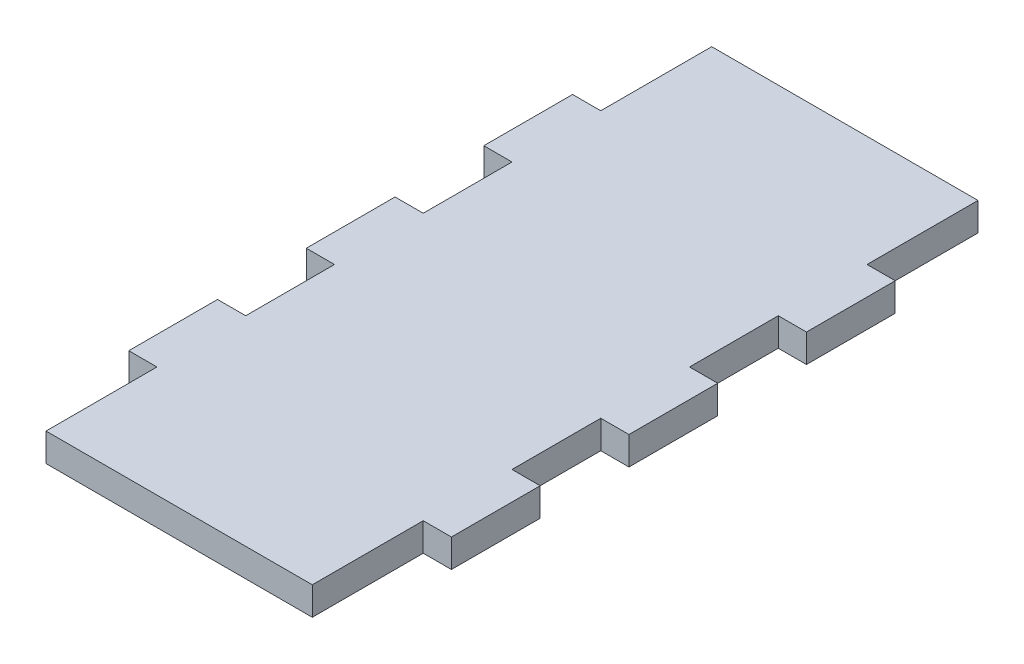
ISO-10303-21;
HEADER;
FILE_DESCRIPTION(('STEP AP214'),'2;1');
FILE_NAME('part.step','',(''),(''),'','','');
FILE_SCHEMA(('AUTOMOTIVE_DESIGN { 1 0 10303 214 1 1 1 1 }'));
ENDSEC;
DATA;
#1=APPLICATION_CONTEXT('core data for automotive mechanical design processes');
#2=APPLICATION_PROTOCOL_DEFINITION('international standard','automotive_design',2000,#1);
#3=PRODUCT_CONTEXT('',#1,'mechanical');
#4=PRODUCT('Part','Part','',(#3));
#5=PRODUCT_RELATED_PRODUCT_CATEGORY('part','',(#4));
#6=PRODUCT_DEFINITION_FORMATION('','',#4);
#7=PRODUCT_DEFINITION_CONTEXT('part definition',#1,'design');
#8=PRODUCT_DEFINITION('design','',#6,#7);
#9=PRODUCT_DEFINITION_SHAPE('','',#8);
#10=(LENGTH_UNIT() NAMED_UNIT(*) SI_UNIT(.MILLI.,.METRE.));
#11=(NAMED_UNIT(*) PLANE_ANGLE_UNIT() SI_UNIT($,.RADIAN.));
#12=(NAMED_UNIT(*) SI_UNIT($,.STERADIAN.) SOLID_ANGLE_UNIT());
#13=UNCERTAINTY_MEASURE_WITH_UNIT(LENGTH_MEASURE(1.E-05),#10,'distance_accuracy_value','');
#14=(GEOMETRIC_REPRESENTATION_CONTEXT(3) GLOBAL_UNCERTAINTY_ASSIGNED_CONTEXT((#13)) GLOBAL_UNIT_ASSIGNED_CONTEXT((#10,
#11,#12)) REPRESENTATION_CONTEXT('',''));
#15=CARTESIAN_POINT('',(0.,0.,0.));
#16=DIRECTION('',(0.,0.,1.));
#17=DIRECTION('',(1.,0.,0.));
#18=AXIS2_PLACEMENT_3D('',#15,#16,#17);
#19=CARTESIAN_POINT('',(15.,3.175,37.5));
#20=DIRECTION('',(-1.,0.,0.));
#21=DIRECTION('',(0.,0.,1.));
#22=AXIS2_PLACEMENT_3D('',#19,#20,#21);
#23=PLANE('',#22);
#24=DIRECTION('',(0.,0.,-1.));
#25=VECTOR('',#24,1.);
#26=CARTESIAN_POINT('',(15.,0.,37.5));
#27=LINE('',#26,#25);
#28=CARTESIAN_POINT('',(15.0000000000001,0.,-4.99999999999994));
#29=VERTEX_POINT('',#28);
#30=CARTESIAN_POINT('',(15.,0.,-15.));
#31=VERTEX_POINT('',#30);
#32=EDGE_CURVE('E439',#29,#31,#27,.T.);
#33=ORIENTED_EDGE('',*,*,#32,.T.);
#34=DIRECTION('',(0.,1.,0.));
#35=VECTOR('',#34,1.);
#36=CARTESIAN_POINT('',(15.0000000000001,-10.491931423718,-15.));
#37=LINE('',#36,#35);
#38=CARTESIAN_POINT('',(15.,3.175,-15.));
#39=VERTEX_POINT('',#38);
#40=EDGE_CURVE('E56',#31,#39,#37,.T.);
#41=ORIENTED_EDGE('',*,*,#40,.T.);
#42=DIRECTION('',(0.,0.,-1.));
#43=VECTOR('',#42,1.);
#44=CARTESIAN_POINT('',(15.,3.175,37.5));
#45=LINE('',#44,#43);
#46=CARTESIAN_POINT('',(15.,3.175,-4.99999999999994));
#47=VERTEX_POINT('',#46);
#48=EDGE_CURVE('E456',#47,#39,#45,.T.);
#49=ORIENTED_EDGE('',*,*,#48,.F.);
#50=DIRECTION('',(0.,1.,0.));
#51=VECTOR('',#50,1.);
#52=CARTESIAN_POINT('',(15.0000000000001,-10.491931423718,-4.99999999999994));
#53=LINE('',#52,#51);
#54=EDGE_CURVE('E270',#29,#47,#53,.T.);
#55=ORIENTED_EDGE('',*,*,#54,.F.);
#56=EDGE_LOOP('',(#33,#41,#49,#55));
#57=FACE_BOUND('',#56,.T.);
#58=ADVANCED_FACE('F33',(#57),#23,.F.);
#59=CARTESIAN_POINT('',(15.,0.,15.));
#60=VERTEX_POINT('',#59);
#61=CARTESIAN_POINT('',(15.,0.,5.00000000000006));
#62=VERTEX_POINT('',#61);
#63=EDGE_CURVE('E407',#60,#62,#27,.T.);
#64=ORIENTED_EDGE('',*,*,#63,.T.);
#65=DIRECTION('',(0.,1.,0.));
#66=VECTOR('',#65,1.);
#67=CARTESIAN_POINT('',(15.,-10.491931423718,5.00000000000006));
#68=LINE('',#67,#66);
#69=CARTESIAN_POINT('',(15.,3.175,5.00000000000006));
#70=VERTEX_POINT('',#69);
#71=EDGE_CURVE('E277',#62,#70,#68,.T.);
#72=ORIENTED_EDGE('',*,*,#71,.T.);
#73=CARTESIAN_POINT('',(15.,3.175,15.));
#74=VERTEX_POINT('',#73);
#75=EDGE_CURVE('E393',#74,#70,#45,.T.);
#76=ORIENTED_EDGE('',*,*,#75,.F.);
#77=DIRECTION('',(0.,1.,0.));
#78=VECTOR('',#77,1.);
#79=CARTESIAN_POINT('',(15.,-10.491931423718,15.));
#80=LINE('',#79,#78);
#81=EDGE_CURVE('E296',#60,#74,#80,.T.);
#82=ORIENTED_EDGE('',*,*,#81,.F.);
#83=EDGE_LOOP('',(#64,#72,#76,#82));
#84=FACE_BOUND('',#83,.T.);
#85=ADVANCED_FACE('F445',(#84),#23,.F.);
#86=CARTESIAN_POINT('',(15.,3.175,-25.));
#87=VERTEX_POINT('',#86);
#88=CARTESIAN_POINT('',(15.,3.175,-37.5));
#89=VERTEX_POINT('',#88);
#90=EDGE_CURVE('E48',#87,#89,#45,.T.);
#91=ORIENTED_EDGE('',*,*,#90,.F.);
#92=DIRECTION('',(0.,1.,0.));
#93=VECTOR('',#92,1.);
#94=CARTESIAN_POINT('',(15.0000000000001,-10.491931423718,-25.));
#95=LINE('',#94,#93);
#96=CARTESIAN_POINT('',(15.0000000000001,0.,-25.));
#97=VERTEX_POINT('',#96);
#98=EDGE_CURVE('E249',#97,#87,#95,.T.);
#99=ORIENTED_EDGE('',*,*,#98,.F.);
#100=CARTESIAN_POINT('',(15.,0.,-37.5));
#101=VERTEX_POINT('',#100);
#102=EDGE_CURVE('E388',#97,#101,#27,.T.);
#103=ORIENTED_EDGE('',*,*,#102,.T.);
#104=DIRECTION('',(0.,-1.,0.));
#105=VECTOR('',#104,1.);
#106=CARTESIAN_POINT('',(15.,3.175,-37.5));
#107=LINE('',#106,#105);
#108=EDGE_CURVE('E11',#89,#101,#107,.T.);
#109=ORIENTED_EDGE('',*,*,#108,.F.);
#110=EDGE_LOOP('',(#91,#99,#103,#109));
#111=FACE_BOUND('',#110,.T.);
#112=ADVANCED_FACE('F438',(#111),#23,.F.);
#113=CARTESIAN_POINT('',(-15.,3.175,37.5));
#114=DIRECTION('',(1.,0.,0.));
#115=DIRECTION('',(0.,0.,-1.));
#116=AXIS2_PLACEMENT_3D('',#113,#114,#115);
#117=PLANE('',#116);
#118=DIRECTION('',(0.,0.,1.));
#119=VECTOR('',#118,1.);
#120=CARTESIAN_POINT('',(-15.,0.,37.5));
#121=LINE('',#120,#119);
#122=CARTESIAN_POINT('',(-15.,0.,-37.5));
#123=VERTEX_POINT('',#122);
#124=CARTESIAN_POINT('',(-15.,0.,-25.));
#125=VERTEX_POINT('',#124);
#126=EDGE_CURVE('E410',#123,#125,#121,.T.);
#127=ORIENTED_EDGE('',*,*,#126,.T.);
#128=DIRECTION('',(0.,1.,0.));
#129=VECTOR('',#128,1.);
#130=CARTESIAN_POINT('',(-15.0000000000001,-10.491931423718,-25.));
#131=LINE('',#130,#129);
#132=CARTESIAN_POINT('',(-15.,3.175,-25.));
#133=VERTEX_POINT('',#132);
#134=EDGE_CURVE('E311',#125,#133,#131,.T.);
#135=ORIENTED_EDGE('',*,*,#134,.T.);
#136=DIRECTION('',(0.,0.,1.));
#137=VECTOR('',#136,1.);
#138=CARTESIAN_POINT('',(-15.,3.175,37.5));
#139=LINE('',#138,#137);
#140=CARTESIAN_POINT('',(-15.,3.175,-37.5));
#141=VERTEX_POINT('',#140);
#142=EDGE_CURVE('E396',#141,#133,#139,.T.);
#143=ORIENTED_EDGE('',*,*,#142,.F.);
#144=DIRECTION('',(0.,-1.,0.));
#145=VECTOR('',#144,1.);
#146=CARTESIAN_POINT('',(-15.,3.175,-37.5));
#147=LINE('',#146,#145);
#148=EDGE_CURVE('E41',#141,#123,#147,.T.);
#149=ORIENTED_EDGE('',*,*,#148,.T.);
#150=EDGE_LOOP('',(#127,#135,#143,#149));
#151=FACE_BOUND('',#150,.T.);
#152=ADVANCED_FACE('F424',(#151),#117,.F.);
#153=CARTESIAN_POINT('',(-15.,3.175,-15.));
#154=VERTEX_POINT('',#153);
#155=CARTESIAN_POINT('',(-15.,3.175,-4.99999999999994));
#156=VERTEX_POINT('',#155);
#157=EDGE_CURVE('E400',#154,#156,#139,.T.);
#158=ORIENTED_EDGE('',*,*,#157,.F.);
#159=DIRECTION('',(0.,1.,0.));
#160=VECTOR('',#159,1.);
#161=CARTESIAN_POINT('',(-15.0000000000001,-10.491931423718,-15.));
#162=LINE('',#161,#160);
#163=CARTESIAN_POINT('',(-15.0000000000001,0.,-15.));
#164=VERTEX_POINT('',#163);
#165=EDGE_CURVE('E320',#164,#154,#162,.T.);
#166=ORIENTED_EDGE('',*,*,#165,.F.);
#167=CARTESIAN_POINT('',(-15.,0.,-4.99999999999994));
#168=VERTEX_POINT('',#167);
#169=EDGE_CURVE('E413',#164,#168,#121,.T.);
#170=ORIENTED_EDGE('',*,*,#169,.T.);
#171=DIRECTION('',(0.,1.,0.));
#172=VECTOR('',#171,1.);
#173=CARTESIAN_POINT('',(-15.0000000000001,-10.491931423718,-4.99999999999994));
#174=LINE('',#173,#172);
#175=EDGE_CURVE('E338',#168,#156,#174,.T.);
#176=ORIENTED_EDGE('',*,*,#175,.T.);
#177=EDGE_LOOP('',(#158,#166,#170,#176));
#178=FACE_BOUND('',#177,.T.);
#179=ADVANCED_FACE('F478',(#178),#117,.F.);
#180=DIRECTION('',(0.,1.,0.));
#181=VECTOR('',#180,1.);
#182=CARTESIAN_POINT('',(-15.,-10.491931423718,25.));
#183=LINE('',#182,#181);
#184=CARTESIAN_POINT('',(-15.,0.,25.));
#185=VERTEX_POINT('',#184);
#186=CARTESIAN_POINT('',(-15.,3.175,25.));
#187=VERTEX_POINT('',#186);
#188=EDGE_CURVE('E377',#185,#187,#183,.T.);
#189=ORIENTED_EDGE('',*,*,#188,.F.);
#190=CARTESIAN_POINT('',(-15.,0.,37.5));
#191=VERTEX_POINT('',#190);
#192=EDGE_CURVE('E409',#185,#191,#121,.T.);
#193=ORIENTED_EDGE('',*,*,#192,.T.);
#194=DIRECTION('',(0.,-1.,0.));
#195=VECTOR('',#194,1.);
#196=CARTESIAN_POINT('',(-15.,3.175,37.5));
#197=LINE('',#196,#195);
#198=CARTESIAN_POINT('',(-15.,3.175,37.5));
#199=VERTEX_POINT('',#198);
#200=EDGE_CURVE('E417',#199,#191,#197,.T.);
#201=ORIENTED_EDGE('',*,*,#200,.F.);
#202=EDGE_CURVE('E395',#187,#199,#139,.T.);
#203=ORIENTED_EDGE('',*,*,#202,.F.);
#204=EDGE_LOOP('',(#189,#193,#201,#203));
#205=FACE_BOUND('',#204,.T.);
#206=ADVANCED_FACE('F471',(#205),#117,.F.);
#207=CARTESIAN_POINT('',(15.,0.,37.5));
#208=VERTEX_POINT('',#207);
#209=CARTESIAN_POINT('',(15.,0.,25.));
#210=VERTEX_POINT('',#209);
#211=EDGE_CURVE('E403',#208,#210,#27,.T.);
#212=ORIENTED_EDGE('',*,*,#211,.T.);
#213=DIRECTION('',(0.,1.,0.));
#214=VECTOR('',#213,1.);
#215=CARTESIAN_POINT('',(15.,-10.491931423718,25.));
#216=LINE('',#215,#214);
#217=CARTESIAN_POINT('',(15.,3.175,25.));
#218=VERTEX_POINT('',#217);
#219=EDGE_CURVE('E302',#210,#218,#216,.T.);
#220=ORIENTED_EDGE('',*,*,#219,.T.);
#221=CARTESIAN_POINT('',(15.,3.175,37.5));
#222=VERTEX_POINT('',#221);
#223=EDGE_CURVE('E389',#222,#218,#45,.T.);
#224=ORIENTED_EDGE('',*,*,#223,.F.);
#225=DIRECTION('',(0.,-1.,0.));
#226=VECTOR('',#225,1.);
#227=CARTESIAN_POINT('',(15.,3.175,37.5));
#228=LINE('',#227,#226);
#229=EDGE_CURVE('E402',#222,#208,#228,.T.);
#230=ORIENTED_EDGE('',*,*,#229,.T.);
#231=EDGE_LOOP('',(#212,#220,#224,#230));
#232=FACE_BOUND('',#231,.T.);
#233=ADVANCED_FACE('F35',(#232),#23,.F.);
#234=CARTESIAN_POINT('',(-15.,3.175,-37.5));
#235=DIRECTION('',(0.,0.,1.));
#236=DIRECTION('',(1.,0.,0.));
#237=AXIS2_PLACEMENT_3D('',#234,#235,#236);
#238=PLANE('',#237);
#239=DIRECTION('',(-1.,0.,0.));
#240=VECTOR('',#239,1.);
#241=CARTESIAN_POINT('',(-15.,0.,-37.5));
#242=LINE('',#241,#240);
#243=EDGE_CURVE('E406',#101,#123,#242,.T.);
#244=ORIENTED_EDGE('',*,*,#243,.T.);
#245=ORIENTED_EDGE('',*,*,#148,.F.);
#246=DIRECTION('',(-1.,0.,0.));
#247=VECTOR('',#246,1.);
#248=CARTESIAN_POINT('',(-15.,3.175,-37.5));
#249=LINE('',#248,#247);
#250=EDGE_CURVE('E392',#89,#141,#249,.T.);
#251=ORIENTED_EDGE('',*,*,#250,.F.);
#252=ORIENTED_EDGE('',*,*,#108,.T.);
#253=EDGE_LOOP('',(#244,#245,#251,#252));
#254=FACE_BOUND('',#253,.T.);
#255=ADVANCED_FACE('F437',(#254),#238,.F.);
#256=CARTESIAN_POINT('',(-15.,3.175,5.00000000000006));
#257=VERTEX_POINT('',#256);
#258=CARTESIAN_POINT('',(-15.,3.175,15.));
#259=VERTEX_POINT('',#258);
#260=EDGE_CURVE('E498',#257,#259,#139,.T.);
#261=ORIENTED_EDGE('',*,*,#260,.F.);
#262=DIRECTION('',(0.,1.,0.));
#263=VECTOR('',#262,1.);
#264=CARTESIAN_POINT('',(-15.,-10.491931423718,5.00000000000006));
#265=LINE('',#264,#263);
#266=CARTESIAN_POINT('',(-15.,0.,5.00000000000006));
#267=VERTEX_POINT('',#266);
#268=EDGE_CURVE('E347',#267,#257,#265,.T.);
#269=ORIENTED_EDGE('',*,*,#268,.F.);
#270=CARTESIAN_POINT('',(-15.,0.,15.));
#271=VERTEX_POINT('',#270);
#272=EDGE_CURVE('E513',#267,#271,#121,.T.);
#273=ORIENTED_EDGE('',*,*,#272,.T.);
#274=DIRECTION('',(0.,1.,0.));
#275=VECTOR('',#274,1.);
#276=CARTESIAN_POINT('',(-15.,-10.491931423718,15.));
#277=LINE('',#276,#275);
#278=EDGE_CURVE('E383',#271,#259,#277,.T.);
#279=ORIENTED_EDGE('',*,*,#278,.T.);
#280=EDGE_LOOP('',(#261,#269,#273,#279));
#281=FACE_BOUND('',#280,.T.);
#282=ADVANCED_FACE('F477',(#281),#117,.F.);
#283=CARTESIAN_POINT('',(-15.,3.175,37.5));
#284=DIRECTION('',(0.,0.,-1.));
#285=DIRECTION('',(-1.,0.,0.));
#286=AXIS2_PLACEMENT_3D('',#283,#284,#285);
#287=PLANE('',#286);
#288=DIRECTION('',(1.,0.,0.));
#289=VECTOR('',#288,1.);
#290=CARTESIAN_POINT('',(-15.,0.,37.5));
#291=LINE('',#290,#289);
#292=EDGE_CURVE('E412',#191,#208,#291,.T.);
#293=ORIENTED_EDGE('',*,*,#292,.T.);
#294=ORIENTED_EDGE('',*,*,#229,.F.);
#295=DIRECTION('',(1.,0.,0.));
#296=VECTOR('',#295,1.);
#297=CARTESIAN_POINT('',(-15.,3.175,37.5));
#298=LINE('',#297,#296);
#299=EDGE_CURVE('E399',#199,#222,#298,.T.);
#300=ORIENTED_EDGE('',*,*,#299,.F.);
#301=ORIENTED_EDGE('',*,*,#200,.T.);
#302=EDGE_LOOP('',(#293,#294,#300,#301));
#303=FACE_BOUND('',#302,.T.);
#304=ADVANCED_FACE('F491',(#303),#287,.F.);
#305=CARTESIAN_POINT('',(0.,3.175,0.));
#306=DIRECTION('',(0.,-1.,0.));
#307=DIRECTION('',(0.,0.,-1.));
#308=AXIS2_PLACEMENT_3D('',#305,#306,#307);
#309=PLANE('',#308);
#310=ORIENTED_EDGE('',*,*,#223,.T.);
#311=DIRECTION('',(1.,0.,0.));
#312=VECTOR('',#311,1.);
#313=CARTESIAN_POINT('',(15.,3.175,25.));
#314=LINE('',#313,#312);
#315=CARTESIAN_POINT('',(18.175,3.175,25.));
#316=VERTEX_POINT('',#315);
#317=EDGE_CURVE('E281',#218,#316,#314,.T.);
#318=ORIENTED_EDGE('',*,*,#317,.T.);
#319=DIRECTION('',(0.,0.,-1.));
#320=VECTOR('',#319,1.);
#321=CARTESIAN_POINT('',(18.175,3.175,25.));
#322=LINE('',#321,#320);
#323=CARTESIAN_POINT('',(18.175,3.175,15.));
#324=VERTEX_POINT('',#323);
#325=EDGE_CURVE('E286',#316,#324,#322,.T.);
#326=ORIENTED_EDGE('',*,*,#325,.T.);
#327=DIRECTION('',(-1.,0.,0.));
#328=VECTOR('',#327,1.);
#329=CARTESIAN_POINT('',(15.,3.175,15.));
#330=LINE('',#329,#328);
#331=EDGE_CURVE('E282',#324,#74,#330,.T.);
#332=ORIENTED_EDGE('',*,*,#331,.T.);
#333=ORIENTED_EDGE('',*,*,#75,.T.);
#334=DIRECTION('',(1.,0.,0.));
#335=VECTOR('',#334,1.);
#336=CARTESIAN_POINT('',(15.,3.175,5.00000000000006));
#337=LINE('',#336,#335);
#338=CARTESIAN_POINT('',(18.1750000000001,3.175,5.00000000000006));
#339=VERTEX_POINT('',#338);
#340=EDGE_CURVE('E254',#70,#339,#337,.T.);
#341=ORIENTED_EDGE('',*,*,#340,.T.);
#342=DIRECTION('',(0.,0.,-1.));
#343=VECTOR('',#342,1.);
#344=CARTESIAN_POINT('',(18.1750000000001,3.175,5.00000000000006));
#345=LINE('',#344,#343);
#346=CARTESIAN_POINT('',(18.1750000000001,3.175,-4.99999999999994));
#347=VERTEX_POINT('',#346);
#348=EDGE_CURVE('E259',#339,#347,#345,.T.);
#349=ORIENTED_EDGE('',*,*,#348,.T.);
#350=DIRECTION('',(-1.,0.,0.));
#351=VECTOR('',#350,1.);
#352=CARTESIAN_POINT('',(15.0000000000001,3.175,-4.99999999999994));
#353=LINE('',#352,#351);
#354=EDGE_CURVE('E255',#347,#47,#353,.T.);
#355=ORIENTED_EDGE('',*,*,#354,.T.);
#356=ORIENTED_EDGE('',*,*,#48,.T.);
#357=DIRECTION('',(1.,0.,0.));
#358=VECTOR('',#357,1.);
#359=CARTESIAN_POINT('',(15.0000000000001,3.175,-15.));
#360=LINE('',#359,#358);
#361=CARTESIAN_POINT('',(18.1750000000001,3.175,-15.));
#362=VERTEX_POINT('',#361);
#363=EDGE_CURVE('E247',#39,#362,#360,.T.);
#364=ORIENTED_EDGE('',*,*,#363,.T.);
#365=DIRECTION('',(0.,0.,-1.));
#366=VECTOR('',#365,1.);
#367=CARTESIAN_POINT('',(18.1750000000001,3.175,-15.));
#368=LINE('',#367,#366);
#369=CARTESIAN_POINT('',(18.1750000000001,3.175,-25.));
#370=VERTEX_POINT('',#369);
#371=EDGE_CURVE('E235',#362,#370,#368,.T.);
#372=ORIENTED_EDGE('',*,*,#371,.T.);
#373=DIRECTION('',(-1.,0.,0.));
#374=VECTOR('',#373,1.);
#375=CARTESIAN_POINT('',(15.0000000000001,3.175,-25.));
#376=LINE('',#375,#374);
#377=EDGE_CURVE('E241',#370,#87,#376,.T.);
#378=ORIENTED_EDGE('',*,*,#377,.T.);
#379=ORIENTED_EDGE('',*,*,#90,.T.);
#380=ORIENTED_EDGE('',*,*,#250,.T.);
#381=ORIENTED_EDGE('',*,*,#142,.T.);
#382=DIRECTION('',(-1.,0.,0.));
#383=VECTOR('',#382,1.);
#384=CARTESIAN_POINT('',(-15.0000000000001,3.175,-25.));
#385=LINE('',#384,#383);
#386=CARTESIAN_POINT('',(-18.1750000000001,3.175,-25.));
#387=VERTEX_POINT('',#386);
#388=EDGE_CURVE('E312',#133,#387,#385,.T.);
#389=ORIENTED_EDGE('',*,*,#388,.T.);
#390=DIRECTION('',(0.,0.,1.));
#391=VECTOR('',#390,1.);
#392=CARTESIAN_POINT('',(-18.1750000000001,3.175,-15.));
#393=LINE('',#392,#391);
#394=CARTESIAN_POINT('',(-18.1750000000001,3.175,-15.));
#395=VERTEX_POINT('',#394);
#396=EDGE_CURVE('E308',#387,#395,#393,.T.);
#397=ORIENTED_EDGE('',*,*,#396,.T.);
#398=DIRECTION('',(1.,0.,0.));
#399=VECTOR('',#398,1.);
#400=CARTESIAN_POINT('',(-15.0000000000001,3.175,-15.));
#401=LINE('',#400,#399);
#402=EDGE_CURVE('E307',#395,#154,#401,.T.);
#403=ORIENTED_EDGE('',*,*,#402,.T.);
#404=ORIENTED_EDGE('',*,*,#157,.T.);
#405=DIRECTION('',(-1.,0.,0.));
#406=VECTOR('',#405,1.);
#407=CARTESIAN_POINT('',(-15.0000000000001,3.175,-4.99999999999994));
#408=LINE('',#407,#406);
#409=CARTESIAN_POINT('',(-18.175,3.175,-4.99999999999994));
#410=VERTEX_POINT('',#409);
#411=EDGE_CURVE('E339',#156,#410,#408,.T.);
#412=ORIENTED_EDGE('',*,*,#411,.T.);
#413=DIRECTION('',(0.,0.,1.));
#414=VECTOR('',#413,1.);
#415=CARTESIAN_POINT('',(-18.1749999999999,3.175,5.00000000000006));
#416=LINE('',#415,#414);
#417=CARTESIAN_POINT('',(-18.1749999999999,3.175,5.00000000000006));
#418=VERTEX_POINT('',#417);
#419=EDGE_CURVE('E335',#410,#418,#416,.T.);
#420=ORIENTED_EDGE('',*,*,#419,.T.);
#421=DIRECTION('',(1.,0.,0.));
#422=VECTOR('',#421,1.);
#423=CARTESIAN_POINT('',(-15.,3.175,5.00000000000006));
#424=LINE('',#423,#422);
#425=EDGE_CURVE('E334',#418,#257,#424,.T.);
#426=ORIENTED_EDGE('',*,*,#425,.T.);
#427=ORIENTED_EDGE('',*,*,#260,.T.);
#428=DIRECTION('',(-1.,0.,0.));
#429=VECTOR('',#428,1.);
#430=CARTESIAN_POINT('',(-15.,3.175,15.));
#431=LINE('',#430,#429);
#432=CARTESIAN_POINT('',(-18.1749999999999,3.175,15.0000000000001));
#433=VERTEX_POINT('',#432);
#434=EDGE_CURVE('E362',#259,#433,#431,.T.);
#435=ORIENTED_EDGE('',*,*,#434,.T.);
#436=DIRECTION('',(0.,0.,1.));
#437=VECTOR('',#436,1.);
#438=CARTESIAN_POINT('',(-18.1749999999998,3.175,25.0000000000001));
#439=LINE('',#438,#437);
#440=CARTESIAN_POINT('',(-18.1749999999998,3.175,25.0000000000001));
#441=VERTEX_POINT('',#440);
#442=EDGE_CURVE('E367',#433,#441,#439,.T.);
#443=ORIENTED_EDGE('',*,*,#442,.T.);
#444=DIRECTION('',(1.,0.,0.));
#445=VECTOR('',#444,1.);
#446=CARTESIAN_POINT('',(-15.,3.175,25.));
#447=LINE('',#446,#445);
#448=EDGE_CURVE('E363',#441,#187,#447,.T.);
#449=ORIENTED_EDGE('',*,*,#448,.T.);
#450=ORIENTED_EDGE('',*,*,#202,.T.);
#451=ORIENTED_EDGE('',*,*,#299,.T.);
#452=EDGE_LOOP('',(#310,#318,#326,#332,#333,#341,#349,#355,#356,#364,#372,#378,#379,#380,#381,
#389,#397,#403,#404,#412,#420,#426,#427,#435,#443,#449,#450,#451));
#453=FACE_BOUND('',#452,.T.);
#454=ADVANCED_FACE('F435',(#453),#309,.F.);
#455=CARTESIAN_POINT('',(0.,0.,0.));
#456=DIRECTION('',(0.,-1.,0.));
#457=DIRECTION('',(0.,0.,-1.));
#458=AXIS2_PLACEMENT_3D('',#455,#456,#457);
#459=PLANE('',#458);
#460=ORIENTED_EDGE('',*,*,#211,.F.);
#461=ORIENTED_EDGE('',*,*,#292,.F.);
#462=ORIENTED_EDGE('',*,*,#192,.F.);
#463=DIRECTION('',(1.,0.,0.));
#464=VECTOR('',#463,1.);
#465=CARTESIAN_POINT('',(-15.,0.,25.));
#466=LINE('',#465,#464);
#467=CARTESIAN_POINT('',(-18.1749999999998,0.,25.0000000000001));
#468=VERTEX_POINT('',#467);
#469=EDGE_CURVE('E375',#468,#185,#466,.T.);
#470=ORIENTED_EDGE('',*,*,#469,.F.);
#471=DIRECTION('',(0.,0.,1.));
#472=VECTOR('',#471,1.);
#473=CARTESIAN_POINT('',(-18.1749999999998,0.,25.0000000000001));
#474=LINE('',#473,#472);
#475=CARTESIAN_POINT('',(-18.1749999999999,0.,15.0000000000001));
#476=VERTEX_POINT('',#475);
#477=EDGE_CURVE('E379',#476,#468,#474,.T.);
#478=ORIENTED_EDGE('',*,*,#477,.F.);
#479=DIRECTION('',(-1.,0.,0.));
#480=VECTOR('',#479,1.);
#481=CARTESIAN_POINT('',(-15.,0.,15.));
#482=LINE('',#481,#480);
#483=EDGE_CURVE('E366',#271,#476,#482,.T.);
#484=ORIENTED_EDGE('',*,*,#483,.F.);
#485=ORIENTED_EDGE('',*,*,#272,.F.);
#486=DIRECTION('',(1.,0.,0.));
#487=VECTOR('',#486,1.);
#488=CARTESIAN_POINT('',(-15.,0.,5.00000000000006));
#489=LINE('',#488,#487);
#490=CARTESIAN_POINT('',(-18.1749999999999,0.,5.00000000000006));
#491=VERTEX_POINT('',#490);
#492=EDGE_CURVE('E344',#491,#267,#489,.T.);
#493=ORIENTED_EDGE('',*,*,#492,.F.);
#494=DIRECTION('',(0.,0.,1.));
#495=VECTOR('',#494,1.);
#496=CARTESIAN_POINT('',(-18.1749999999999,0.,5.00000000000006));
#497=LINE('',#496,#495);
#498=CARTESIAN_POINT('',(-18.175,0.,-4.99999999999994));
#499=VERTEX_POINT('',#498);
#500=EDGE_CURVE('E349',#499,#491,#497,.T.);
#501=ORIENTED_EDGE('',*,*,#500,.F.);
#502=DIRECTION('',(-1.,0.,0.));
#503=VECTOR('',#502,1.);
#504=CARTESIAN_POINT('',(-15.0000000000001,0.,-4.99999999999994));
#505=LINE('',#504,#503);
#506=EDGE_CURVE('E353',#168,#499,#505,.T.);
#507=ORIENTED_EDGE('',*,*,#506,.F.);
#508=ORIENTED_EDGE('',*,*,#169,.F.);
#509=DIRECTION('',(1.,0.,0.));
#510=VECTOR('',#509,1.);
#511=CARTESIAN_POINT('',(-15.0000000000001,0.,-15.));
#512=LINE('',#511,#510);
#513=CARTESIAN_POINT('',(-18.1750000000001,0.,-15.));
#514=VERTEX_POINT('',#513);
#515=EDGE_CURVE('E317',#514,#164,#512,.T.);
#516=ORIENTED_EDGE('',*,*,#515,.F.);
#517=DIRECTION('',(0.,0.,1.));
#518=VECTOR('',#517,1.);
#519=CARTESIAN_POINT('',(-18.1750000000001,0.,-15.));
#520=LINE('',#519,#518);
#521=CARTESIAN_POINT('',(-18.1750000000001,0.,-25.));
#522=VERTEX_POINT('',#521);
#523=EDGE_CURVE('E322',#522,#514,#520,.T.);
#524=ORIENTED_EDGE('',*,*,#523,.F.);
#525=DIRECTION('',(-1.,0.,0.));
#526=VECTOR('',#525,1.);
#527=CARTESIAN_POINT('',(-15.0000000000001,0.,-25.));
#528=LINE('',#527,#526);
#529=EDGE_CURVE('E326',#125,#522,#528,.T.);
#530=ORIENTED_EDGE('',*,*,#529,.F.);
#531=ORIENTED_EDGE('',*,*,#126,.F.);
#532=ORIENTED_EDGE('',*,*,#243,.F.);
#533=ORIENTED_EDGE('',*,*,#102,.F.);
#534=DIRECTION('',(-1.,0.,0.));
#535=VECTOR('',#534,1.);
#536=CARTESIAN_POINT('',(15.0000000000001,0.,-25.));
#537=LINE('',#536,#535);
#538=CARTESIAN_POINT('',(18.1750000000001,0.,-25.));
#539=VERTEX_POINT('',#538);
#540=EDGE_CURVE('E226',#539,#97,#537,.T.);
#541=ORIENTED_EDGE('',*,*,#540,.F.);
#542=DIRECTION('',(0.,0.,-1.));
#543=VECTOR('',#542,1.);
#544=CARTESIAN_POINT('',(18.1750000000001,0.,-15.));
#545=LINE('',#544,#543);
#546=CARTESIAN_POINT('',(18.1750000000001,0.,-15.));
#547=VERTEX_POINT('',#546);
#548=EDGE_CURVE('E219',#547,#539,#545,.T.);
#549=ORIENTED_EDGE('',*,*,#548,.F.);
#550=DIRECTION('',(1.,0.,0.));
#551=VECTOR('',#550,1.);
#552=CARTESIAN_POINT('',(15.0000000000001,0.,-15.));
#553=LINE('',#552,#551);
#554=EDGE_CURVE('E224',#31,#547,#553,.T.);
#555=ORIENTED_EDGE('',*,*,#554,.F.);
#556=ORIENTED_EDGE('',*,*,#32,.F.);
#557=DIRECTION('',(-1.,0.,0.));
#558=VECTOR('',#557,1.);
#559=CARTESIAN_POINT('',(15.0000000000001,0.,-4.99999999999994));
#560=LINE('',#559,#558);
#561=CARTESIAN_POINT('',(18.1750000000001,0.,-4.99999999999994));
#562=VERTEX_POINT('',#561);
#563=EDGE_CURVE('E267',#562,#29,#560,.T.);
#564=ORIENTED_EDGE('',*,*,#563,.F.);
#565=DIRECTION('',(0.,0.,-1.));
#566=VECTOR('',#565,1.);
#567=CARTESIAN_POINT('',(18.1750000000001,0.,5.00000000000006));
#568=LINE('',#567,#566);
#569=CARTESIAN_POINT('',(18.1750000000001,0.,5.00000000000006));
#570=VERTEX_POINT('',#569);
#571=EDGE_CURVE('E272',#570,#562,#568,.T.);
#572=ORIENTED_EDGE('',*,*,#571,.F.);
#573=DIRECTION('',(1.,0.,0.));
#574=VECTOR('',#573,1.);
#575=CARTESIAN_POINT('',(15.,0.,5.00000000000006));
#576=LINE('',#575,#574);
#577=EDGE_CURVE('E258',#62,#570,#576,.T.);
#578=ORIENTED_EDGE('',*,*,#577,.F.);
#579=ORIENTED_EDGE('',*,*,#63,.F.);
#580=DIRECTION('',(-1.,0.,0.));
#581=VECTOR('',#580,1.);
#582=CARTESIAN_POINT('',(15.,0.,15.));
#583=LINE('',#582,#581);
#584=CARTESIAN_POINT('',(18.175,0.,15.));
#585=VERTEX_POINT('',#584);
#586=EDGE_CURVE('E294',#585,#60,#583,.T.);
#587=ORIENTED_EDGE('',*,*,#586,.F.);
#588=DIRECTION('',(0.,0.,-1.));
#589=VECTOR('',#588,1.);
#590=CARTESIAN_POINT('',(18.175,0.,25.));
#591=LINE('',#590,#589);
#592=CARTESIAN_POINT('',(18.175,0.,25.));
#593=VERTEX_POINT('',#592);
#594=EDGE_CURVE('E298',#593,#585,#591,.T.);
#595=ORIENTED_EDGE('',*,*,#594,.F.);
#596=DIRECTION('',(1.,0.,0.));
#597=VECTOR('',#596,1.);
#598=CARTESIAN_POINT('',(15.,0.,25.));
#599=LINE('',#598,#597);
#600=EDGE_CURVE('E285',#210,#593,#599,.T.);
#601=ORIENTED_EDGE('',*,*,#600,.F.);
#602=EDGE_LOOP('',(#460,#461,#462,#470,#478,#484,#485,#493,#501,#507,#508,#516,#524,#530,#531,
#532,#533,#541,#549,#555,#556,#564,#572,#578,#579,#587,#595,#601));
#603=FACE_BOUND('',#602,.T.);
#604=ADVANCED_FACE('F222',(#603),#459,.T.);
#605=CARTESIAN_POINT('',(-15.,-10.491931423718,15.));
#606=DIRECTION('',(0.,0.,-1.));
#607=DIRECTION('',(-1.,0.,0.));
#608=AXIS2_PLACEMENT_3D('',#605,#606,#607);
#609=PLANE('',#608);
#610=ORIENTED_EDGE('',*,*,#278,.F.);
#611=ORIENTED_EDGE('',*,*,#483,.T.);
#612=DIRECTION('',(0.,1.,0.));
#613=VECTOR('',#612,1.);
#614=CARTESIAN_POINT('',(-18.1749999999999,-10.491931423718,15.0000000000001));
#615=LINE('',#614,#613);
#616=EDGE_CURVE('E374',#476,#433,#615,.T.);
#617=ORIENTED_EDGE('',*,*,#616,.T.);
#618=ORIENTED_EDGE('',*,*,#434,.F.);
#619=EDGE_LOOP('',(#610,#611,#617,#618));
#620=FACE_BOUND('',#619,.T.);
#621=ADVANCED_FACE('F532',(#620),#609,.T.);
#622=CARTESIAN_POINT('',(-18.1749999999998,-10.491931423718,25.0000000000001));
#623=DIRECTION('',(-1.,0.,0.));
#624=DIRECTION('',(0.,0.,1.));
#625=AXIS2_PLACEMENT_3D('',#622,#623,#624);
#626=PLANE('',#625);
#627=ORIENTED_EDGE('',*,*,#616,.F.);
#628=ORIENTED_EDGE('',*,*,#477,.T.);
#629=DIRECTION('',(0.,1.,0.));
#630=VECTOR('',#629,1.);
#631=CARTESIAN_POINT('',(-18.1749999999998,-10.491931423718,25.0000000000001));
#632=LINE('',#631,#630);
#633=EDGE_CURVE('E378',#468,#441,#632,.T.);
#634=ORIENTED_EDGE('',*,*,#633,.T.);
#635=ORIENTED_EDGE('',*,*,#442,.F.);
#636=EDGE_LOOP('',(#627,#628,#634,#635));
#637=FACE_BOUND('',#636,.T.);
#638=ADVANCED_FACE('F530',(#637),#626,.T.);
#639=CARTESIAN_POINT('',(-15.,-10.491931423718,25.));
#640=DIRECTION('',(0.,0.,1.));
#641=DIRECTION('',(1.,0.,0.));
#642=AXIS2_PLACEMENT_3D('',#639,#640,#641);
#643=PLANE('',#642);
#644=ORIENTED_EDGE('',*,*,#633,.F.);
#645=ORIENTED_EDGE('',*,*,#469,.T.);
#646=ORIENTED_EDGE('',*,*,#188,.T.);
#647=ORIENTED_EDGE('',*,*,#448,.F.);
#648=EDGE_LOOP('',(#644,#645,#646,#647));
#649=FACE_BOUND('',#648,.T.);
#650=ADVANCED_FACE('F527',(#649),#643,.T.);
#651=CARTESIAN_POINT('',(-15.0000000000001,-10.491931423718,-4.99999999999994));
#652=DIRECTION('',(0.,0.,-1.));
#653=DIRECTION('',(-1.,0.,0.));
#654=AXIS2_PLACEMENT_3D('',#651,#652,#653);
#655=PLANE('',#654);
#656=ORIENTED_EDGE('',*,*,#175,.F.);
#657=ORIENTED_EDGE('',*,*,#506,.T.);
#658=DIRECTION('',(0.,1.,0.));
#659=VECTOR('',#658,1.);
#660=CARTESIAN_POINT('',(-18.175,-10.491931423718,-4.99999999999994));
#661=LINE('',#660,#659);
#662=EDGE_CURVE('E352',#499,#410,#661,.T.);
#663=ORIENTED_EDGE('',*,*,#662,.T.);
#664=ORIENTED_EDGE('',*,*,#411,.F.);
#665=EDGE_LOOP('',(#656,#657,#663,#664));
#666=FACE_BOUND('',#665,.T.);
#667=ADVANCED_FACE('F572',(#666),#655,.T.);
#668=CARTESIAN_POINT('',(-18.1749999999999,-10.491931423718,5.00000000000006));
#669=DIRECTION('',(-1.,0.,0.));
#670=DIRECTION('',(0.,0.,1.));
#671=AXIS2_PLACEMENT_3D('',#668,#669,#670);
#672=PLANE('',#671);
#673=ORIENTED_EDGE('',*,*,#662,.F.);
#674=ORIENTED_EDGE('',*,*,#500,.T.);
#675=DIRECTION('',(0.,1.,0.));
#676=VECTOR('',#675,1.);
#677=CARTESIAN_POINT('',(-18.1749999999999,-10.491931423718,5.00000000000006));
#678=LINE('',#677,#676);
#679=EDGE_CURVE('E348',#491,#418,#678,.T.);
#680=ORIENTED_EDGE('',*,*,#679,.T.);
#681=ORIENTED_EDGE('',*,*,#419,.F.);
#682=EDGE_LOOP('',(#673,#674,#680,#681));
#683=FACE_BOUND('',#682,.T.);
#684=ADVANCED_FACE('F509',(#683),#672,.T.);
#685=CARTESIAN_POINT('',(-15.,-10.491931423718,5.00000000000006));
#686=DIRECTION('',(0.,0.,1.));
#687=DIRECTION('',(1.,0.,0.));
#688=AXIS2_PLACEMENT_3D('',#685,#686,#687);
#689=PLANE('',#688);
#690=ORIENTED_EDGE('',*,*,#679,.F.);
#691=ORIENTED_EDGE('',*,*,#492,.T.);
#692=ORIENTED_EDGE('',*,*,#268,.T.);
#693=ORIENTED_EDGE('',*,*,#425,.F.);
#694=EDGE_LOOP('',(#690,#691,#692,#693));
#695=FACE_BOUND('',#694,.T.);
#696=ADVANCED_FACE('F504',(#695),#689,.T.);
#697=CARTESIAN_POINT('',(-15.0000000000001,-10.491931423718,-25.));
#698=DIRECTION('',(0.,0.,-1.));
#699=DIRECTION('',(-1.,0.,0.));
#700=AXIS2_PLACEMENT_3D('',#697,#698,#699);
#701=PLANE('',#700);
#702=ORIENTED_EDGE('',*,*,#134,.F.);
#703=ORIENTED_EDGE('',*,*,#529,.T.);
#704=DIRECTION('',(0.,1.,0.));
#705=VECTOR('',#704,1.);
#706=CARTESIAN_POINT('',(-18.1750000000001,-10.491931423718,-25.));
#707=LINE('',#706,#705);
#708=EDGE_CURVE('E325',#522,#387,#707,.T.);
#709=ORIENTED_EDGE('',*,*,#708,.T.);
#710=ORIENTED_EDGE('',*,*,#388,.F.);
#711=EDGE_LOOP('',(#702,#703,#709,#710));
#712=FACE_BOUND('',#711,.T.);
#713=ADVANCED_FACE('F433',(#712),#701,.T.);
#714=CARTESIAN_POINT('',(-18.1750000000001,-10.491931423718,-15.));
#715=DIRECTION('',(-1.,0.,0.));
#716=DIRECTION('',(0.,0.,1.));
#717=AXIS2_PLACEMENT_3D('',#714,#715,#716);
#718=PLANE('',#717);
#719=ORIENTED_EDGE('',*,*,#708,.F.);
#720=ORIENTED_EDGE('',*,*,#523,.T.);
#721=DIRECTION('',(0.,1.,0.));
#722=VECTOR('',#721,1.);
#723=CARTESIAN_POINT('',(-18.1750000000001,-10.491931423718,-15.));
#724=LINE('',#723,#722);
#725=EDGE_CURVE('E321',#514,#395,#724,.T.);
#726=ORIENTED_EDGE('',*,*,#725,.T.);
#727=ORIENTED_EDGE('',*,*,#396,.F.);
#728=EDGE_LOOP('',(#719,#720,#726,#727));
#729=FACE_BOUND('',#728,.T.);
#730=ADVANCED_FACE('F605',(#729),#718,.T.);
#731=CARTESIAN_POINT('',(-15.0000000000001,-10.491931423718,-15.));
#732=DIRECTION('',(0.,0.,1.));
#733=DIRECTION('',(1.,0.,0.));
#734=AXIS2_PLACEMENT_3D('',#731,#732,#733);
#735=PLANE('',#734);
#736=ORIENTED_EDGE('',*,*,#725,.F.);
#737=ORIENTED_EDGE('',*,*,#515,.T.);
#738=ORIENTED_EDGE('',*,*,#165,.T.);
#739=ORIENTED_EDGE('',*,*,#402,.F.);
#740=EDGE_LOOP('',(#736,#737,#738,#739));
#741=FACE_BOUND('',#740,.T.);
#742=ADVANCED_FACE('F614',(#741),#735,.T.);
#743=CARTESIAN_POINT('',(15.,-10.491931423718,25.));
#744=DIRECTION('',(0.,0.,1.));
#745=DIRECTION('',(1.,0.,0.));
#746=AXIS2_PLACEMENT_3D('',#743,#744,#745);
#747=PLANE('',#746);
#748=ORIENTED_EDGE('',*,*,#219,.F.);
#749=ORIENTED_EDGE('',*,*,#600,.T.);
#750=DIRECTION('',(0.,1.,0.));
#751=VECTOR('',#750,1.);
#752=CARTESIAN_POINT('',(18.175,-10.491931423718,25.));
#753=LINE('',#752,#751);
#754=EDGE_CURVE('E293',#593,#316,#753,.T.);
#755=ORIENTED_EDGE('',*,*,#754,.T.);
#756=ORIENTED_EDGE('',*,*,#317,.F.);
#757=EDGE_LOOP('',(#748,#749,#755,#756));
#758=FACE_BOUND('',#757,.T.);
#759=ADVANCED_FACE('F624',(#758),#747,.T.);
#760=CARTESIAN_POINT('',(18.175,-10.491931423718,25.));
#761=DIRECTION('',(1.,0.,0.));
#762=DIRECTION('',(0.,0.,-1.));
#763=AXIS2_PLACEMENT_3D('',#760,#761,#762);
#764=PLANE('',#763);
#765=ORIENTED_EDGE('',*,*,#754,.F.);
#766=ORIENTED_EDGE('',*,*,#594,.T.);
#767=DIRECTION('',(0.,1.,0.));
#768=VECTOR('',#767,1.);
#769=CARTESIAN_POINT('',(18.175,-10.491931423718,15.));
#770=LINE('',#769,#768);
#771=EDGE_CURVE('E297',#585,#324,#770,.T.);
#772=ORIENTED_EDGE('',*,*,#771,.T.);
#773=ORIENTED_EDGE('',*,*,#325,.F.);
#774=EDGE_LOOP('',(#765,#766,#772,#773));
#775=FACE_BOUND('',#774,.T.);
#776=ADVANCED_FACE('F634',(#775),#764,.T.);
#777=CARTESIAN_POINT('',(15.,-10.491931423718,15.));
#778=DIRECTION('',(0.,0.,-1.));
#779=DIRECTION('',(-1.,0.,0.));
#780=AXIS2_PLACEMENT_3D('',#777,#778,#779);
#781=PLANE('',#780);
#782=ORIENTED_EDGE('',*,*,#771,.F.);
#783=ORIENTED_EDGE('',*,*,#586,.T.);
#784=ORIENTED_EDGE('',*,*,#81,.T.);
#785=ORIENTED_EDGE('',*,*,#331,.F.);
#786=EDGE_LOOP('',(#782,#783,#784,#785));
#787=FACE_BOUND('',#786,.T.);
#788=ADVANCED_FACE('F644',(#787),#781,.T.);
#789=CARTESIAN_POINT('',(15.,-10.491931423718,5.00000000000006));
#790=DIRECTION('',(0.,0.,1.));
#791=DIRECTION('',(1.,0.,0.));
#792=AXIS2_PLACEMENT_3D('',#789,#790,#791);
#793=PLANE('',#792);
#794=ORIENTED_EDGE('',*,*,#71,.F.);
#795=ORIENTED_EDGE('',*,*,#577,.T.);
#796=DIRECTION('',(0.,1.,0.));
#797=VECTOR('',#796,1.);
#798=CARTESIAN_POINT('',(18.1750000000001,-10.491931423718,5.00000000000006));
#799=LINE('',#798,#797);
#800=EDGE_CURVE('E266',#570,#339,#799,.T.);
#801=ORIENTED_EDGE('',*,*,#800,.T.);
#802=ORIENTED_EDGE('',*,*,#340,.F.);
#803=EDGE_LOOP('',(#794,#795,#801,#802));
#804=FACE_BOUND('',#803,.T.);
#805=ADVANCED_FACE('F452',(#804),#793,.T.);
#806=CARTESIAN_POINT('',(18.1750000000001,-10.491931423718,5.00000000000006));
#807=DIRECTION('',(1.,0.,0.));
#808=DIRECTION('',(0.,0.,-1.));
#809=AXIS2_PLACEMENT_3D('',#806,#807,#808);
#810=PLANE('',#809);
#811=ORIENTED_EDGE('',*,*,#800,.F.);
#812=ORIENTED_EDGE('',*,*,#571,.T.);
#813=DIRECTION('',(0.,1.,0.));
#814=VECTOR('',#813,1.);
#815=CARTESIAN_POINT('',(18.1750000000001,-10.491931423718,-4.99999999999994));
#816=LINE('',#815,#814);
#817=EDGE_CURVE('E271',#562,#347,#816,.T.);
#818=ORIENTED_EDGE('',*,*,#817,.T.);
#819=ORIENTED_EDGE('',*,*,#348,.F.);
#820=EDGE_LOOP('',(#811,#812,#818,#819));
#821=FACE_BOUND('',#820,.T.);
#822=ADVANCED_FACE('F663',(#821),#810,.T.);
#823=CARTESIAN_POINT('',(15.0000000000001,-10.491931423718,-4.99999999999994));
#824=DIRECTION('',(0.,0.,-1.));
#825=DIRECTION('',(-1.,0.,0.));
#826=AXIS2_PLACEMENT_3D('',#823,#824,#825);
#827=PLANE('',#826);
#828=ORIENTED_EDGE('',*,*,#817,.F.);
#829=ORIENTED_EDGE('',*,*,#563,.T.);
#830=ORIENTED_EDGE('',*,*,#54,.T.);
#831=ORIENTED_EDGE('',*,*,#354,.F.);
#832=EDGE_LOOP('',(#828,#829,#830,#831));
#833=FACE_BOUND('',#832,.T.);
#834=ADVANCED_FACE('F672',(#833),#827,.T.);
#835=CARTESIAN_POINT('',(15.0000000000001,-10.491931423718,-15.));
#836=DIRECTION('',(0.,0.,1.));
#837=DIRECTION('',(1.,0.,0.));
#838=AXIS2_PLACEMENT_3D('',#835,#836,#837);
#839=PLANE('',#838);
#840=ORIENTED_EDGE('',*,*,#40,.F.);
#841=ORIENTED_EDGE('',*,*,#554,.T.);
#842=DIRECTION('',(0.,1.,0.));
#843=VECTOR('',#842,1.);
#844=CARTESIAN_POINT('',(18.1750000000001,-10.491931423718,-15.));
#845=LINE('',#844,#843);
#846=EDGE_CURVE('E230',#547,#362,#845,.T.);
#847=ORIENTED_EDGE('',*,*,#846,.T.);
#848=ORIENTED_EDGE('',*,*,#363,.F.);
#849=EDGE_LOOP('',(#840,#841,#847,#848));
#850=FACE_BOUND('',#849,.T.);
#851=ADVANCED_FACE('F240',(#850),#839,.T.);
#852=CARTESIAN_POINT('',(18.1750000000001,-10.491931423718,-15.));
#853=DIRECTION('',(1.,0.,0.));
#854=DIRECTION('',(0.,0.,-1.));
#855=AXIS2_PLACEMENT_3D('',#852,#853,#854);
#856=PLANE('',#855);
#857=ORIENTED_EDGE('',*,*,#846,.F.);
#858=ORIENTED_EDGE('',*,*,#548,.T.);
#859=DIRECTION('',(0.,1.,0.));
#860=VECTOR('',#859,1.);
#861=CARTESIAN_POINT('',(18.1750000000001,-10.491931423718,-25.));
#862=LINE('',#861,#860);
#863=EDGE_CURVE('E229',#539,#370,#862,.T.);
#864=ORIENTED_EDGE('',*,*,#863,.T.);
#865=ORIENTED_EDGE('',*,*,#371,.F.);
#866=EDGE_LOOP('',(#857,#858,#864,#865));
#867=FACE_BOUND('',#866,.T.);
#868=ADVANCED_FACE('F233',(#867),#856,.T.);
#869=CARTESIAN_POINT('',(15.0000000000001,-10.491931423718,-25.));
#870=DIRECTION('',(0.,0.,-1.));
#871=DIRECTION('',(-1.,0.,0.));
#872=AXIS2_PLACEMENT_3D('',#869,#870,#871);
#873=PLANE('',#872);
#874=ORIENTED_EDGE('',*,*,#863,.F.);
#875=ORIENTED_EDGE('',*,*,#540,.T.);
#876=ORIENTED_EDGE('',*,*,#98,.T.);
#877=ORIENTED_EDGE('',*,*,#377,.F.);
#878=EDGE_LOOP('',(#874,#875,#876,#877));
#879=FACE_BOUND('',#878,.T.);
#880=ADVANCED_FACE('F459',(#879),#873,.T.);
#881=CLOSED_SHELL('',(#58,#85,#112,#152,#179,#206,#233,#255,#282,#304,#454,#604,#621,#638,#650,
#667,#684,#696,#713,#730,#742,#759,#776,#788,#805,#822,#834,#851,#868,#880));
#882=MANIFOLD_SOLID_BREP('B2',#881);
#883=ADVANCED_BREP_SHAPE_REPRESENTATION('',(#18,#882),#14);
#884=SHAPE_DEFINITION_REPRESENTATION(#9,#883);
ENDSEC;
END-ISO-10303-21;
